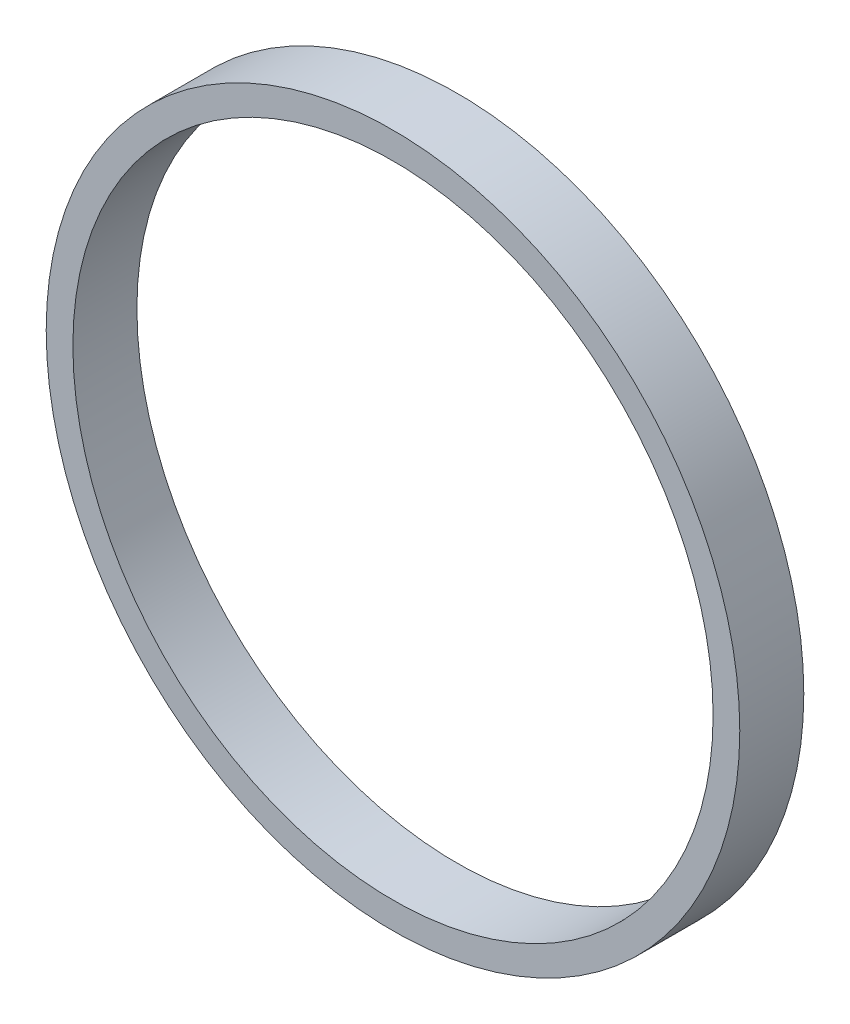
ISO-10303-21;
HEADER;
FILE_DESCRIPTION(('STEP AP214'),'2;1');
FILE_NAME('part.step','',(''),(''),'','','');
FILE_SCHEMA(('AUTOMOTIVE_DESIGN { 1 0 10303 214 1 1 1 1 }'));
ENDSEC;
DATA;
#1=APPLICATION_CONTEXT('core data for automotive mechanical design processes');
#2=APPLICATION_PROTOCOL_DEFINITION('international standard','automotive_design',2000,#1);
#3=PRODUCT_CONTEXT('',#1,'mechanical');
#4=PRODUCT('Part','Part','',(#3));
#5=PRODUCT_RELATED_PRODUCT_CATEGORY('part','',(#4));
#6=PRODUCT_DEFINITION_FORMATION('','',#4);
#7=PRODUCT_DEFINITION_CONTEXT('part definition',#1,'design');
#8=PRODUCT_DEFINITION('design','',#6,#7);
#9=PRODUCT_DEFINITION_SHAPE('','',#8);
#10=(LENGTH_UNIT() NAMED_UNIT(*) SI_UNIT(.MILLI.,.METRE.));
#11=(NAMED_UNIT(*) PLANE_ANGLE_UNIT() SI_UNIT($,.RADIAN.));
#12=(NAMED_UNIT(*) SI_UNIT($,.STERADIAN.) SOLID_ANGLE_UNIT());
#13=UNCERTAINTY_MEASURE_WITH_UNIT(LENGTH_MEASURE(1.E-05),#10,'distance_accuracy_value','');
#14=(GEOMETRIC_REPRESENTATION_CONTEXT(3) GLOBAL_UNCERTAINTY_ASSIGNED_CONTEXT((#13)) GLOBAL_UNIT_ASSIGNED_CONTEXT((#10,
#11,#12)) REPRESENTATION_CONTEXT('',''));
#15=CARTESIAN_POINT('',(0.,0.,0.));
#16=DIRECTION('',(0.,0.,1.));
#17=DIRECTION('',(1.,0.,0.));
#18=AXIS2_PLACEMENT_3D('',#15,#16,#17);
#19=CARTESIAN_POINT('',(0.,0.,6.));
#20=DIRECTION('',(0.,0.,1.));
#21=DIRECTION('',(1.,0.,0.));
#22=AXIS2_PLACEMENT_3D('',#19,#20,#21);
#23=PLANE('',#22);
#24=CARTESIAN_POINT('',(0.,0.,6.));
#25=DIRECTION('',(0.,0.,1.));
#26=DIRECTION('',(1.,0.,0.));
#27=AXIS2_PLACEMENT_3D('',#24,#25,#26);
#28=CIRCLE('',#27,32.5);
#29=CARTESIAN_POINT('',(32.5,0.,6.));
#30=VERTEX_POINT('',#29);
#31=EDGE_CURVE('E10',#30,#30,#28,.T.);
#32=ORIENTED_EDGE('',*,*,#31,.T.);
#33=EDGE_LOOP('',(#32));
#34=FACE_BOUND('',#33,.T.);
#35=CARTESIAN_POINT('',(0.,0.,6.));
#36=DIRECTION('',(0.,0.,1.));
#37=DIRECTION('',(1.,0.,0.));
#38=AXIS2_PLACEMENT_3D('',#35,#36,#37);
#39=CIRCLE('',#38,30.);
#40=CARTESIAN_POINT('',(30.,0.,6.));
#41=VERTEX_POINT('',#40);
#42=EDGE_CURVE('E42',#41,#41,#39,.T.);
#43=ORIENTED_EDGE('',*,*,#42,.F.);
#44=EDGE_LOOP('',(#43));
#45=FACE_BOUND('',#44,.T.);
#46=ADVANCED_FACE('F31',(#34,#45),#23,.T.);
#47=CARTESIAN_POINT('',(0.,0.,0.));
#48=DIRECTION('',(0.,0.,1.));
#49=DIRECTION('',(1.,0.,0.));
#50=AXIS2_PLACEMENT_3D('',#47,#48,#49);
#51=PLANE('',#50);
#52=CARTESIAN_POINT('',(0.,0.,0.));
#53=DIRECTION('',(0.,0.,1.));
#54=DIRECTION('',(1.,0.,0.));
#55=AXIS2_PLACEMENT_3D('',#52,#53,#54);
#56=CIRCLE('',#55,32.5);
#57=CARTESIAN_POINT('',(32.5,0.,0.));
#58=VERTEX_POINT('',#57);
#59=EDGE_CURVE('E35',#58,#58,#56,.T.);
#60=ORIENTED_EDGE('',*,*,#59,.F.);
#61=EDGE_LOOP('',(#60));
#62=FACE_BOUND('',#61,.T.);
#63=CARTESIAN_POINT('',(0.,0.,0.));
#64=DIRECTION('',(0.,0.,1.));
#65=DIRECTION('',(1.,0.,0.));
#66=AXIS2_PLACEMENT_3D('',#63,#64,#65);
#67=CIRCLE('',#66,30.);
#68=CARTESIAN_POINT('',(30.,0.,0.));
#69=VERTEX_POINT('',#68);
#70=EDGE_CURVE('E44',#69,#69,#67,.T.);
#71=ORIENTED_EDGE('',*,*,#70,.T.);
#72=EDGE_LOOP('',(#71));
#73=FACE_BOUND('',#72,.T.);
#74=ADVANCED_FACE('F54',(#62,#73),#51,.F.);
#75=CARTESIAN_POINT('',(0.,0.,6.));
#76=DIRECTION('',(0.,0.,-1.));
#77=DIRECTION('',(-1.,0.,0.));
#78=AXIS2_PLACEMENT_3D('',#75,#76,#77);
#79=CYLINDRICAL_SURFACE('',#78,32.5);
#80=ORIENTED_EDGE('',*,*,#31,.F.);
#81=EDGE_LOOP('',(#80));
#82=FACE_BOUND('',#81,.T.);
#83=ORIENTED_EDGE('',*,*,#59,.T.);
#84=EDGE_LOOP('',(#83));
#85=FACE_BOUND('',#84,.T.);
#86=ADVANCED_FACE('F33',(#82,#85),#79,.T.);
#87=CARTESIAN_POINT('',(0.,0.,6.));
#88=DIRECTION('',(0.,0.,-1.));
#89=DIRECTION('',(-1.,0.,0.));
#90=AXIS2_PLACEMENT_3D('',#87,#88,#89);
#91=CYLINDRICAL_SURFACE('',#90,30.);
#92=ORIENTED_EDGE('',*,*,#42,.T.);
#93=EDGE_LOOP('',(#92));
#94=FACE_BOUND('',#93,.T.);
#95=ORIENTED_EDGE('',*,*,#70,.F.);
#96=EDGE_LOOP('',(#95));
#97=FACE_BOUND('',#96,.T.);
#98=ADVANCED_FACE('F50',(#94,#97),#91,.F.);
#99=CLOSED_SHELL('',(#46,#74,#86,#98));
#100=MANIFOLD_SOLID_BREP('B2',#99);
#101=ADVANCED_BREP_SHAPE_REPRESENTATION('',(#18,#100),#14);
#102=SHAPE_DEFINITION_REPRESENTATION(#9,#101);
ENDSEC;
END-ISO-10303-21;
